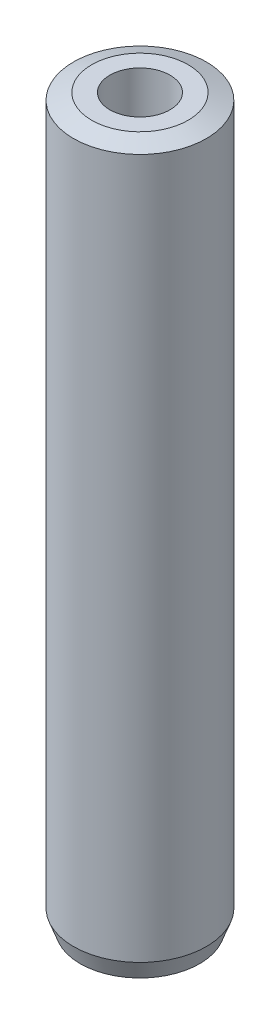
ISO-10303-21;
HEADER;
FILE_DESCRIPTION(('STEP AP214'),'2;1');
FILE_NAME('part.step','',(''),(''),'','','');
FILE_SCHEMA(('AUTOMOTIVE_DESIGN { 1 0 10303 214 1 1 1 1 }'));
ENDSEC;
DATA;
#1=APPLICATION_CONTEXT('core data for automotive mechanical design processes');
#2=APPLICATION_PROTOCOL_DEFINITION('international standard','automotive_design',2000,#1);
#3=PRODUCT_CONTEXT('',#1,'mechanical');
#4=PRODUCT('Part','Part','',(#3));
#5=PRODUCT_RELATED_PRODUCT_CATEGORY('part','',(#4));
#6=PRODUCT_DEFINITION_FORMATION('','',#4);
#7=PRODUCT_DEFINITION_CONTEXT('part definition',#1,'design');
#8=PRODUCT_DEFINITION('design','',#6,#7);
#9=PRODUCT_DEFINITION_SHAPE('','',#8);
#10=(LENGTH_UNIT() NAMED_UNIT(*) SI_UNIT(.MILLI.,.METRE.));
#11=(NAMED_UNIT(*) PLANE_ANGLE_UNIT() SI_UNIT($,.RADIAN.));
#12=(NAMED_UNIT(*) SI_UNIT($,.STERADIAN.) SOLID_ANGLE_UNIT());
#13=UNCERTAINTY_MEASURE_WITH_UNIT(LENGTH_MEASURE(1.E-05),#10,'distance_accuracy_value','');
#14=(GEOMETRIC_REPRESENTATION_CONTEXT(3) GLOBAL_UNCERTAINTY_ASSIGNED_CONTEXT((#13)) GLOBAL_UNIT_ASSIGNED_CONTEXT((#10,
#11,#12)) REPRESENTATION_CONTEXT('',''));
#15=CARTESIAN_POINT('',(0.,0.,0.));
#16=DIRECTION('',(0.,0.,1.));
#17=DIRECTION('',(1.,0.,0.));
#18=AXIS2_PLACEMENT_3D('',#15,#16,#17);
#19=CARTESIAN_POINT('',(0.,600.,0.));
#20=DIRECTION('',(0.,-1.,0.));
#21=DIRECTION('',(0.,0.,-1.));
#22=AXIS2_PLACEMENT_3D('',#19,#20,#21);
#23=CYLINDRICAL_SURFACE('',#22,55.);
#24=CARTESIAN_POINT('',(0.,594.434213538065,0.));
#25=DIRECTION('',(0.,1.,0.));
#26=DIRECTION('',(0.,0.,1.));
#27=AXIS2_PLACEMENT_3D('',#24,#25,#26);
#28=CIRCLE('',#27,55.);
#29=CARTESIAN_POINT('',(0.,594.434213538065,55.));
#30=VERTEX_POINT('',#29);
#31=EDGE_CURVE('E50',#30,#30,#28,.F.);
#32=ORIENTED_EDGE('',*,*,#31,.T.);
#33=EDGE_LOOP('',(#32));
#34=FACE_BOUND('',#33,.T.);
#35=CARTESIAN_POINT('',(0.,15.1014635093812,0.));
#36=DIRECTION('',(0.,1.,0.));
#37=DIRECTION('',(0.,0.,1.));
#38=AXIS2_PLACEMENT_3D('',#35,#36,#37);
#39=CIRCLE('',#38,55.);
#40=CARTESIAN_POINT('',(0.,15.1014635093812,55.));
#41=VERTEX_POINT('',#40);
#42=EDGE_CURVE('E51',#41,#41,#39,.T.);
#43=ORIENTED_EDGE('',*,*,#42,.T.);
#44=EDGE_LOOP('',(#43));
#45=FACE_BOUND('',#44,.T.);
#46=ADVANCED_FACE('F39',(#34,#45),#23,.T.);
#47=CARTESIAN_POINT('',(0.,600.,0.));
#48=DIRECTION('',(0.,1.,0.));
#49=DIRECTION('',(0.,0.,1.));
#50=AXIS2_PLACEMENT_3D('',#47,#48,#49);
#51=PLANE('',#50);
#52=CARTESIAN_POINT('',(0.,600.,0.));
#53=DIRECTION('',(0.,1.,0.));
#54=DIRECTION('',(0.,0.,1.));
#55=AXIS2_PLACEMENT_3D('',#52,#53,#54);
#56=CIRCLE('',#55,39.8985364906185);
#57=CARTESIAN_POINT('',(0.,600.,39.8985364906185));
#58=VERTEX_POINT('',#57);
#59=EDGE_CURVE('E54',#58,#58,#56,.T.);
#60=ORIENTED_EDGE('',*,*,#59,.T.);
#61=EDGE_LOOP('',(#60));
#62=FACE_BOUND('',#61,.T.);
#63=CARTESIAN_POINT('',(0.,600.,0.));
#64=DIRECTION('',(0.,1.,0.));
#65=DIRECTION('',(0.,0.,1.));
#66=AXIS2_PLACEMENT_3D('',#63,#64,#65);
#67=CIRCLE('',#66,24.9072979340445);
#68=CARTESIAN_POINT('',(0.,600.,24.9072979340445));
#69=VERTEX_POINT('',#68);
#70=EDGE_CURVE('E58',#69,#69,#67,.T.);
#71=ORIENTED_EDGE('',*,*,#70,.F.);
#72=EDGE_LOOP('',(#71));
#73=FACE_BOUND('',#72,.T.);
#74=ADVANCED_FACE('F69',(#62,#73),#51,.T.);
#75=CARTESIAN_POINT('',(0.,0.,0.));
#76=DIRECTION('',(0.,1.,0.));
#77=DIRECTION('',(0.,0.,1.));
#78=AXIS2_PLACEMENT_3D('',#75,#76,#77);
#79=PLANE('',#78);
#80=CARTESIAN_POINT('',(0.,0.,0.));
#81=DIRECTION('',(0.,1.,0.));
#82=DIRECTION('',(0.,0.,1.));
#83=AXIS2_PLACEMENT_3D('',#80,#81,#82);
#84=CIRCLE('',#83,49.4342135380647);
#85=CARTESIAN_POINT('',(0.,0.,49.4342135380647));
#86=VERTEX_POINT('',#85);
#87=EDGE_CURVE('E10',#86,#86,#84,.F.);
#88=ORIENTED_EDGE('',*,*,#87,.T.);
#89=EDGE_LOOP('',(#88));
#90=FACE_BOUND('',#89,.T.);
#91=CARTESIAN_POINT('',(0.,0.,0.));
#92=DIRECTION('',(0.,1.,0.));
#93=DIRECTION('',(0.,0.,1.));
#94=AXIS2_PLACEMENT_3D('',#91,#92,#93);
#95=CIRCLE('',#94,24.9072979340445);
#96=CARTESIAN_POINT('',(0.,0.,24.9072979340445));
#97=VERTEX_POINT('',#96);
#98=EDGE_CURVE('E63',#97,#97,#95,.T.);
#99=ORIENTED_EDGE('',*,*,#98,.T.);
#100=EDGE_LOOP('',(#99));
#101=FACE_BOUND('',#100,.T.);
#102=ADVANCED_FACE('F75',(#90,#101),#79,.F.);
#103=CARTESIAN_POINT('',(0.,600.,0.));
#104=DIRECTION('',(0.,-1.,0.));
#105=DIRECTION('',(0.,0.,-1.));
#106=AXIS2_PLACEMENT_3D('',#103,#104,#105);
#107=CYLINDRICAL_SURFACE('',#106,24.9072979340445);
#108=ORIENTED_EDGE('',*,*,#70,.T.);
#109=EDGE_LOOP('',(#108));
#110=FACE_BOUND('',#109,.T.);
#111=ORIENTED_EDGE('',*,*,#98,.F.);
#112=EDGE_LOOP('',(#111));
#113=FACE_BOUND('',#112,.T.);
#114=ADVANCED_FACE('F70',(#110,#113),#107,.F.);
#115=CARTESIAN_POINT('',(0.,600.,0.));
#116=DIRECTION('',(0.,-1.,0.));
#117=DIRECTION('',(0.,0.,-1.));
#118=AXIS2_PLACEMENT_3D('',#115,#116,#117);
#119=CONICAL_SURFACE('',#118,39.8985364906185,1.21768412358077);
#120=ORIENTED_EDGE('',*,*,#31,.F.);
#121=EDGE_LOOP('',(#120));
#122=FACE_BOUND('',#121,.T.);
#123=ORIENTED_EDGE('',*,*,#59,.F.);
#124=EDGE_LOOP('',(#123));
#125=FACE_BOUND('',#124,.T.);
#126=ADVANCED_FACE('F81',(#122,#125),#119,.T.);
#127=CARTESIAN_POINT('',(0.,15.1014635093812,0.));
#128=DIRECTION('',(0.,1.,0.));
#129=DIRECTION('',(0.,0.,1.));
#130=AXIS2_PLACEMENT_3D('',#127,#128,#129);
#131=CONICAL_SURFACE('',#130,55.,0.353112203214131);
#132=ORIENTED_EDGE('',*,*,#87,.F.);
#133=EDGE_LOOP('',(#132));
#134=FACE_BOUND('',#133,.T.);
#135=ORIENTED_EDGE('',*,*,#42,.F.);
#136=EDGE_LOOP('',(#135));
#137=FACE_BOUND('',#136,.T.);
#138=ADVANCED_FACE('F45',(#134,#137),#131,.T.);
#139=CLOSED_SHELL('',(#46,#74,#102,#114,#126,#138));
#140=MANIFOLD_SOLID_BREP('B2',#139);
#141=ADVANCED_BREP_SHAPE_REPRESENTATION('',(#18,#140),#14);
#142=SHAPE_DEFINITION_REPRESENTATION(#9,#141);
ENDSEC;
END-ISO-10303-21;
